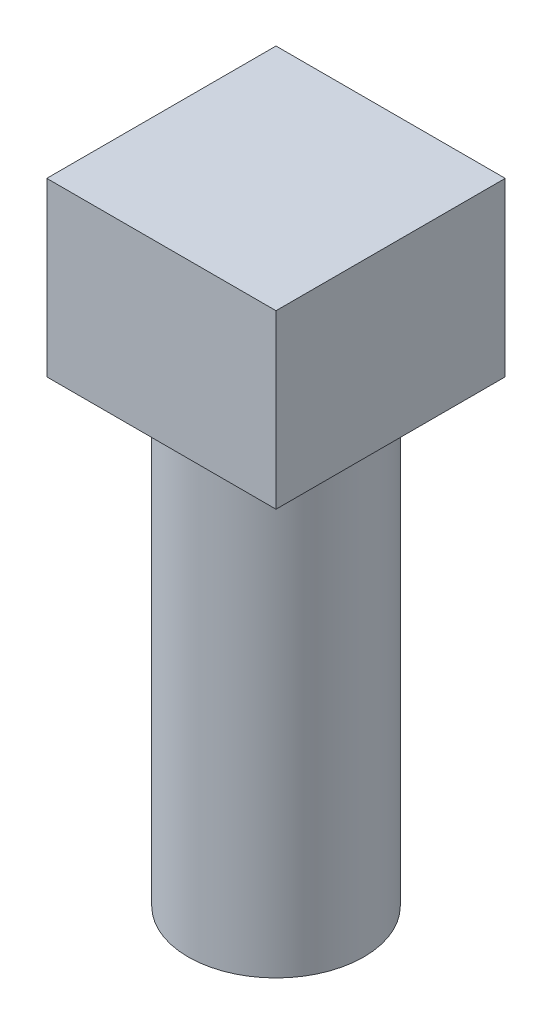
ISO-10303-21;
HEADER;
FILE_DESCRIPTION(('STEP AP214'),'2;1');
FILE_NAME('part.step','',(''),(''),'','','');
FILE_SCHEMA(('AUTOMOTIVE_DESIGN { 1 0 10303 214 1 1 1 1 }'));
ENDSEC;
DATA;
#1=APPLICATION_CONTEXT('core data for automotive mechanical design processes');
#2=APPLICATION_PROTOCOL_DEFINITION('international standard','automotive_design',2000,#1);
#3=PRODUCT_CONTEXT('',#1,'mechanical');
#4=PRODUCT('Part','Part','',(#3));
#5=PRODUCT_RELATED_PRODUCT_CATEGORY('part','',(#4));
#6=PRODUCT_DEFINITION_FORMATION('','',#4);
#7=PRODUCT_DEFINITION_CONTEXT('part definition',#1,'design');
#8=PRODUCT_DEFINITION('design','',#6,#7);
#9=PRODUCT_DEFINITION_SHAPE('','',#8);
#10=(LENGTH_UNIT() NAMED_UNIT(*) SI_UNIT(.MILLI.,.METRE.));
#11=(NAMED_UNIT(*) PLANE_ANGLE_UNIT() SI_UNIT($,.RADIAN.));
#12=(NAMED_UNIT(*) SI_UNIT($,.STERADIAN.) SOLID_ANGLE_UNIT());
#13=UNCERTAINTY_MEASURE_WITH_UNIT(LENGTH_MEASURE(1.E-05),#10,'distance_accuracy_value','');
#14=(GEOMETRIC_REPRESENTATION_CONTEXT(3) GLOBAL_UNCERTAINTY_ASSIGNED_CONTEXT((#13)) GLOBAL_UNIT_ASSIGNED_CONTEXT((#10,
#11,#12)) REPRESENTATION_CONTEXT('',''));
#15=CARTESIAN_POINT('',(0.,0.,0.));
#16=DIRECTION('',(0.,0.,1.));
#17=DIRECTION('',(1.,0.,0.));
#18=AXIS2_PLACEMENT_3D('',#15,#16,#17);
#19=CARTESIAN_POINT('',(0.,30.48,0.));
#20=DIRECTION('',(0.,-1.,0.));
#21=DIRECTION('',(0.,0.,-1.));
#22=AXIS2_PLACEMENT_3D('',#19,#20,#21);
#23=CYLINDRICAL_SURFACE('',#22,5.842);
#24=CARTESIAN_POINT('',(0.,30.48,0.));
#25=DIRECTION('',(0.,1.,0.));
#26=DIRECTION('',(0.,0.,1.));
#27=AXIS2_PLACEMENT_3D('',#24,#25,#26);
#28=CIRCLE('',#27,5.842);
#29=CARTESIAN_POINT('',(0.,30.48,5.842));
#30=VERTEX_POINT('',#29);
#31=EDGE_CURVE('E11',#30,#30,#28,.T.);
#32=ORIENTED_EDGE('',*,*,#31,.F.);
#33=EDGE_LOOP('',(#32));
#34=FACE_BOUND('',#33,.T.);
#35=CARTESIAN_POINT('',(0.,0.,0.));
#36=DIRECTION('',(0.,1.,0.));
#37=DIRECTION('',(0.,0.,1.));
#38=AXIS2_PLACEMENT_3D('',#35,#36,#37);
#39=CIRCLE('',#38,5.842);
#40=CARTESIAN_POINT('',(0.,0.,5.842));
#41=VERTEX_POINT('',#40);
#42=EDGE_CURVE('E37',#41,#41,#39,.T.);
#43=ORIENTED_EDGE('',*,*,#42,.T.);
#44=EDGE_LOOP('',(#43));
#45=FACE_BOUND('',#44,.T.);
#46=ADVANCED_FACE('F34',(#34,#45),#23,.T.);
#47=CARTESIAN_POINT('',(0.,0.,0.));
#48=DIRECTION('',(0.,1.,0.));
#49=DIRECTION('',(0.,0.,1.));
#50=AXIS2_PLACEMENT_3D('',#47,#48,#49);
#51=PLANE('',#50);
#52=ORIENTED_EDGE('',*,*,#42,.F.);
#53=EDGE_LOOP('',(#52));
#54=FACE_BOUND('',#53,.T.);
#55=ADVANCED_FACE('F113',(#54),#51,.F.);
#56=CARTESIAN_POINT('',(0.,30.48,0.));
#57=DIRECTION('',(0.,-1.,0.));
#58=DIRECTION('',(0.,0.,-1.));
#59=AXIS2_PLACEMENT_3D('',#56,#57,#58);
#60=PLANE('',#59);
#61=DIRECTION('',(0.,0.,-1.));
#62=VECTOR('',#61,1.);
#63=CARTESIAN_POINT('',(7.62,30.48,7.62));
#64=LINE('',#63,#62);
#65=CARTESIAN_POINT('',(7.62,30.48,7.62));
#66=VERTEX_POINT('',#65);
#67=CARTESIAN_POINT('',(7.62,30.48,-7.62));
#68=VERTEX_POINT('',#67);
#69=EDGE_CURVE('E101',#66,#68,#64,.T.);
#70=ORIENTED_EDGE('',*,*,#69,.F.);
#71=DIRECTION('',(1.,0.,0.));
#72=VECTOR('',#71,1.);
#73=CARTESIAN_POINT('',(-7.62,30.48,7.62));
#74=LINE('',#73,#72);
#75=CARTESIAN_POINT('',(-7.62,30.48,7.62));
#76=VERTEX_POINT('',#75);
#77=EDGE_CURVE('E73',#76,#66,#74,.T.);
#78=ORIENTED_EDGE('',*,*,#77,.F.);
#79=DIRECTION('',(0.,0.,1.));
#80=VECTOR('',#79,1.);
#81=CARTESIAN_POINT('',(-7.62,30.48,7.62));
#82=LINE('',#81,#80);
#83=CARTESIAN_POINT('',(-7.62,30.48,-7.62));
#84=VERTEX_POINT('',#83);
#85=EDGE_CURVE('E67',#84,#76,#82,.T.);
#86=ORIENTED_EDGE('',*,*,#85,.F.);
#87=DIRECTION('',(-1.,0.,0.));
#88=VECTOR('',#87,1.);
#89=CARTESIAN_POINT('',(-7.62,30.48,-7.62));
#90=LINE('',#89,#88);
#91=EDGE_CURVE('E91',#68,#84,#90,.T.);
#92=ORIENTED_EDGE('',*,*,#91,.F.);
#93=EDGE_LOOP('',(#70,#78,#86,#92));
#94=FACE_BOUND('',#93,.T.);
#95=ORIENTED_EDGE('',*,*,#31,.T.);
#96=EDGE_LOOP('',(#95));
#97=FACE_BOUND('',#96,.T.);
#98=ADVANCED_FACE('F115',(#94,#97),#60,.T.);
#99=CARTESIAN_POINT('',(7.62,41.91,7.62));
#100=DIRECTION('',(-1.,0.,0.));
#101=DIRECTION('',(0.,0.,1.));
#102=AXIS2_PLACEMENT_3D('',#99,#100,#101);
#103=PLANE('',#102);
#104=ORIENTED_EDGE('',*,*,#69,.T.);
#105=DIRECTION('',(0.,-1.,0.));
#106=VECTOR('',#105,1.);
#107=CARTESIAN_POINT('',(7.62,41.91,-7.62));
#108=LINE('',#107,#106);
#109=CARTESIAN_POINT('',(7.62,41.91,-7.62));
#110=VERTEX_POINT('',#109);
#111=EDGE_CURVE('E92',#110,#68,#108,.T.);
#112=ORIENTED_EDGE('',*,*,#111,.F.);
#113=DIRECTION('',(0.,0.,-1.));
#114=VECTOR('',#113,1.);
#115=CARTESIAN_POINT('',(7.62,41.91,7.62));
#116=LINE('',#115,#114);
#117=CARTESIAN_POINT('',(7.62,41.91,7.62));
#118=VERTEX_POINT('',#117);
#119=EDGE_CURVE('E86',#118,#110,#116,.T.);
#120=ORIENTED_EDGE('',*,*,#119,.F.);
#121=DIRECTION('',(0.,-1.,0.));
#122=VECTOR('',#121,1.);
#123=CARTESIAN_POINT('',(7.62,41.91,7.62));
#124=LINE('',#123,#122);
#125=EDGE_CURVE('E97',#118,#66,#124,.T.);
#126=ORIENTED_EDGE('',*,*,#125,.T.);
#127=EDGE_LOOP('',(#104,#112,#120,#126));
#128=FACE_BOUND('',#127,.T.);
#129=ADVANCED_FACE('F120',(#128),#103,.F.);
#130=CARTESIAN_POINT('',(-7.62,41.91,-7.62));
#131=DIRECTION('',(0.,0.,1.));
#132=DIRECTION('',(1.,0.,0.));
#133=AXIS2_PLACEMENT_3D('',#130,#131,#132);
#134=PLANE('',#133);
#135=ORIENTED_EDGE('',*,*,#91,.T.);
#136=DIRECTION('',(0.,-1.,0.));
#137=VECTOR('',#136,1.);
#138=CARTESIAN_POINT('',(-7.62,41.91,-7.62));
#139=LINE('',#138,#137);
#140=CARTESIAN_POINT('',(-7.62,41.91,-7.62));
#141=VERTEX_POINT('',#140);
#142=EDGE_CURVE('E89',#141,#84,#139,.T.);
#143=ORIENTED_EDGE('',*,*,#142,.F.);
#144=DIRECTION('',(-1.,0.,0.));
#145=VECTOR('',#144,1.);
#146=CARTESIAN_POINT('',(-7.62,41.91,-7.62));
#147=LINE('',#146,#145);
#148=EDGE_CURVE('E81',#110,#141,#147,.T.);
#149=ORIENTED_EDGE('',*,*,#148,.F.);
#150=ORIENTED_EDGE('',*,*,#111,.T.);
#151=EDGE_LOOP('',(#135,#143,#149,#150));
#152=FACE_BOUND('',#151,.T.);
#153=ADVANCED_FACE('F90',(#152),#134,.F.);
#154=CARTESIAN_POINT('',(-7.62,41.91,7.62));
#155=DIRECTION('',(1.,0.,0.));
#156=DIRECTION('',(0.,0.,-1.));
#157=AXIS2_PLACEMENT_3D('',#154,#155,#156);
#158=PLANE('',#157);
#159=ORIENTED_EDGE('',*,*,#85,.T.);
#160=DIRECTION('',(0.,-1.,0.));
#161=VECTOR('',#160,1.);
#162=CARTESIAN_POINT('',(-7.62,41.91,7.62));
#163=LINE('',#162,#161);
#164=CARTESIAN_POINT('',(-7.62,41.91,7.62));
#165=VERTEX_POINT('',#164);
#166=EDGE_CURVE('E93',#165,#76,#163,.T.);
#167=ORIENTED_EDGE('',*,*,#166,.F.);
#168=DIRECTION('',(0.,0.,1.));
#169=VECTOR('',#168,1.);
#170=CARTESIAN_POINT('',(-7.62,41.91,7.62));
#171=LINE('',#170,#169);
#172=EDGE_CURVE('E84',#141,#165,#171,.T.);
#173=ORIENTED_EDGE('',*,*,#172,.F.);
#174=ORIENTED_EDGE('',*,*,#142,.T.);
#175=EDGE_LOOP('',(#159,#167,#173,#174));
#176=FACE_BOUND('',#175,.T.);
#177=ADVANCED_FACE('F95',(#176),#158,.F.);
#178=CARTESIAN_POINT('',(-7.62,41.91,7.62));
#179=DIRECTION('',(0.,0.,-1.));
#180=DIRECTION('',(-1.,0.,0.));
#181=AXIS2_PLACEMENT_3D('',#178,#179,#180);
#182=PLANE('',#181);
#183=ORIENTED_EDGE('',*,*,#77,.T.);
#184=ORIENTED_EDGE('',*,*,#125,.F.);
#185=DIRECTION('',(1.,0.,0.));
#186=VECTOR('',#185,1.);
#187=CARTESIAN_POINT('',(-7.62,41.91,7.62));
#188=LINE('',#187,#186);
#189=EDGE_CURVE('E50',#165,#118,#188,.T.);
#190=ORIENTED_EDGE('',*,*,#189,.F.);
#191=ORIENTED_EDGE('',*,*,#166,.T.);
#192=EDGE_LOOP('',(#183,#184,#190,#191));
#193=FACE_BOUND('',#192,.T.);
#194=ADVANCED_FACE('F132',(#193),#182,.F.);
#195=CARTESIAN_POINT('',(0.,41.91,0.));
#196=DIRECTION('',(0.,-1.,0.));
#197=DIRECTION('',(0.,0.,-1.));
#198=AXIS2_PLACEMENT_3D('',#195,#196,#197);
#199=PLANE('',#198);
#200=ORIENTED_EDGE('',*,*,#119,.T.);
#201=ORIENTED_EDGE('',*,*,#148,.T.);
#202=ORIENTED_EDGE('',*,*,#172,.T.);
#203=ORIENTED_EDGE('',*,*,#189,.T.);
#204=EDGE_LOOP('',(#200,#201,#202,#203));
#205=FACE_BOUND('',#204,.T.);
#206=ADVANCED_FACE('F82',(#205),#199,.F.);
#207=CLOSED_SHELL('',(#46,#55,#98,#129,#153,#177,#194,#206));
#208=MANIFOLD_SOLID_BREP('B2',#207);
#209=ADVANCED_BREP_SHAPE_REPRESENTATION('',(#18,#208),#14);
#210=SHAPE_DEFINITION_REPRESENTATION(#9,#209);
ENDSEC;
END-ISO-10303-21;
